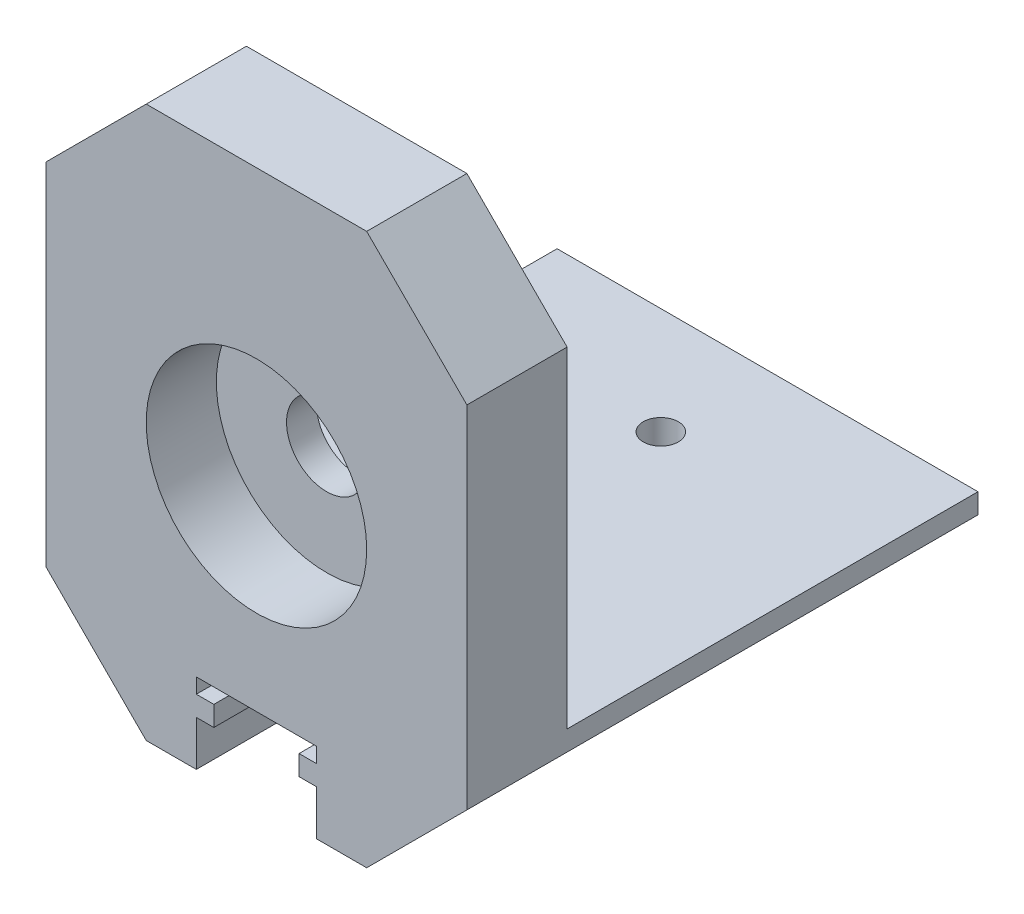
ISO-10303-21;
HEADER;
FILE_DESCRIPTION(('STEP AP214'),'2;1');
FILE_NAME('part.step','',(''),(''),'','','');
FILE_SCHEMA(('AUTOMOTIVE_DESIGN { 1 0 10303 214 1 1 1 1 }'));
ENDSEC;
DATA;
#1=APPLICATION_CONTEXT('core data for automotive mechanical design processes');
#2=APPLICATION_PROTOCOL_DEFINITION('international standard','automotive_design',2000,#1);
#3=PRODUCT_CONTEXT('',#1,'mechanical');
#4=PRODUCT('Part','Part','',(#3));
#5=PRODUCT_RELATED_PRODUCT_CATEGORY('part','',(#4));
#6=PRODUCT_DEFINITION_FORMATION('','',#4);
#7=PRODUCT_DEFINITION_CONTEXT('part definition',#1,'design');
#8=PRODUCT_DEFINITION('design','',#6,#7);
#9=PRODUCT_DEFINITION_SHAPE('','',#8);
#10=(LENGTH_UNIT() NAMED_UNIT(*) SI_UNIT(.MILLI.,.METRE.));
#11=(NAMED_UNIT(*) PLANE_ANGLE_UNIT() SI_UNIT($,.RADIAN.));
#12=(NAMED_UNIT(*) SI_UNIT($,.STERADIAN.) SOLID_ANGLE_UNIT());
#13=UNCERTAINTY_MEASURE_WITH_UNIT(LENGTH_MEASURE(1.E-05),#10,'distance_accuracy_value','');
#14=(GEOMETRIC_REPRESENTATION_CONTEXT(3) GLOBAL_UNCERTAINTY_ASSIGNED_CONTEXT((#13)) GLOBAL_UNIT_ASSIGNED_CONTEXT((#10,
#11,#12)) REPRESENTATION_CONTEXT('',''));
#15=CARTESIAN_POINT('',(0.,0.,0.));
#16=DIRECTION('',(0.,0.,1.));
#17=DIRECTION('',(1.,0.,0.));
#18=AXIS2_PLACEMENT_3D('',#15,#16,#17);
#19=CARTESIAN_POINT('',(21.,-27.5,10.));
#20=DIRECTION('',(-1.,0.,0.));
#21=DIRECTION('',(0.,0.,1.));
#22=AXIS2_PLACEMENT_3D('',#19,#20,#21);
#23=PLANE('',#22);
#24=DIRECTION('',(0.,1.,0.));
#25=VECTOR('',#24,1.);
#26=CARTESIAN_POINT('',(21.,-27.5,10.));
#27=LINE('',#26,#25);
#28=CARTESIAN_POINT('',(21.,-17.5,10.));
#29=VERTEX_POINT('',#28);
#30=CARTESIAN_POINT('',(21.,17.5,10.));
#31=VERTEX_POINT('',#30);
#32=EDGE_CURVE('E272',#29,#31,#27,.T.);
#33=ORIENTED_EDGE('',*,*,#32,.F.);
#34=DIRECTION('',(0.,0.,-1.));
#35=VECTOR('',#34,1.);
#36=CARTESIAN_POINT('',(21.,-17.5,10.));
#37=LINE('',#36,#35);
#38=CARTESIAN_POINT('',(21.,-17.5,-41.));
#39=VERTEX_POINT('',#38);
#40=EDGE_CURVE('E354',#29,#39,#37,.T.);
#41=ORIENTED_EDGE('',*,*,#40,.T.);
#42=DIRECTION('',(0.,-1.,0.));
#43=VECTOR('',#42,1.);
#44=CARTESIAN_POINT('',(21.,-27.5,-41.));
#45=LINE('',#44,#43);
#46=CARTESIAN_POINT('',(21.,-15.5,-41.));
#47=VERTEX_POINT('',#46);
#48=EDGE_CURVE('E197',#47,#39,#45,.T.);
#49=ORIENTED_EDGE('',*,*,#48,.F.);
#50=DIRECTION('',(0.,0.,1.));
#51=VECTOR('',#50,1.);
#52=CARTESIAN_POINT('',(21.,-15.5,-41.));
#53=LINE('',#52,#51);
#54=CARTESIAN_POINT('',(21.,-15.5,0.));
#55=VERTEX_POINT('',#54);
#56=EDGE_CURVE('E249',#47,#55,#53,.T.);
#57=ORIENTED_EDGE('',*,*,#56,.T.);
#58=DIRECTION('',(0.,1.,0.));
#59=VECTOR('',#58,1.);
#60=CARTESIAN_POINT('',(21.,-27.5,0.));
#61=LINE('',#60,#59);
#62=CARTESIAN_POINT('',(21.,17.5,0.));
#63=VERTEX_POINT('',#62);
#64=EDGE_CURVE('E269',#55,#63,#61,.T.);
#65=ORIENTED_EDGE('',*,*,#64,.T.);
#66=DIRECTION('',(0.,0.,1.));
#67=VECTOR('',#66,1.);
#68=CARTESIAN_POINT('',(21.,17.5,10.));
#69=LINE('',#68,#67);
#70=EDGE_CURVE('E352',#63,#31,#69,.T.);
#71=ORIENTED_EDGE('',*,*,#70,.T.);
#72=EDGE_LOOP('',(#33,#41,#49,#57,#65,#71));
#73=FACE_BOUND('',#72,.T.);
#74=ADVANCED_FACE('F34',(#73),#23,.F.);
#75=CARTESIAN_POINT('',(-21.,27.5,10.));
#76=DIRECTION('',(0.,-1.,0.));
#77=DIRECTION('',(0.,0.,-1.));
#78=AXIS2_PLACEMENT_3D('',#75,#76,#77);
#79=PLANE('',#78);
#80=DIRECTION('',(-1.,0.,0.));
#81=VECTOR('',#80,1.);
#82=CARTESIAN_POINT('',(-21.,27.5,0.));
#83=LINE('',#82,#81);
#84=CARTESIAN_POINT('',(11.,27.5,0.));
#85=VERTEX_POINT('',#84);
#86=CARTESIAN_POINT('',(-11.,27.5,0.));
#87=VERTEX_POINT('',#86);
#88=EDGE_CURVE('E309',#85,#87,#83,.T.);
#89=ORIENTED_EDGE('',*,*,#88,.T.);
#90=DIRECTION('',(0.,0.,1.));
#91=VECTOR('',#90,1.);
#92=CARTESIAN_POINT('',(-11.,27.5,10.));
#93=LINE('',#92,#91);
#94=CARTESIAN_POINT('',(-11.,27.5,10.));
#95=VERTEX_POINT('',#94);
#96=EDGE_CURVE('E11',#87,#95,#93,.T.);
#97=ORIENTED_EDGE('',*,*,#96,.T.);
#98=DIRECTION('',(-1.,0.,0.));
#99=VECTOR('',#98,1.);
#100=CARTESIAN_POINT('',(-21.,27.5,10.));
#101=LINE('',#100,#99);
#102=CARTESIAN_POINT('',(11.,27.5,10.));
#103=VERTEX_POINT('',#102);
#104=EDGE_CURVE('E275',#103,#95,#101,.T.);
#105=ORIENTED_EDGE('',*,*,#104,.F.);
#106=DIRECTION('',(0.,0.,-1.));
#107=VECTOR('',#106,1.);
#108=CARTESIAN_POINT('',(11.,27.5,10.));
#109=LINE('',#108,#107);
#110=EDGE_CURVE('E43',#103,#85,#109,.T.);
#111=ORIENTED_EDGE('',*,*,#110,.T.);
#112=EDGE_LOOP('',(#89,#97,#105,#111));
#113=FACE_BOUND('',#112,.T.);
#114=ADVANCED_FACE('F362',(#113),#79,.F.);
#115=CARTESIAN_POINT('',(-21.,-27.5,10.));
#116=DIRECTION('',(1.,0.,0.));
#117=DIRECTION('',(0.,0.,-1.));
#118=AXIS2_PLACEMENT_3D('',#115,#116,#117);
#119=PLANE('',#118);
#120=DIRECTION('',(0.,1.,0.));
#121=VECTOR('',#120,1.);
#122=CARTESIAN_POINT('',(-21.,-27.5,-41.));
#123=LINE('',#122,#121);
#124=CARTESIAN_POINT('',(-21.,-17.5,-41.));
#125=VERTEX_POINT('',#124);
#126=CARTESIAN_POINT('',(-21.,-15.5,-41.));
#127=VERTEX_POINT('',#126);
#128=EDGE_CURVE('E245',#125,#127,#123,.T.);
#129=ORIENTED_EDGE('',*,*,#128,.F.);
#130=DIRECTION('',(0.,0.,1.));
#131=VECTOR('',#130,1.);
#132=CARTESIAN_POINT('',(-21.,-17.5,10.));
#133=LINE('',#132,#131);
#134=CARTESIAN_POINT('',(-21.,-17.5,10.));
#135=VERTEX_POINT('',#134);
#136=EDGE_CURVE('E342',#125,#135,#133,.T.);
#137=ORIENTED_EDGE('',*,*,#136,.T.);
#138=DIRECTION('',(0.,-1.,0.));
#139=VECTOR('',#138,1.);
#140=CARTESIAN_POINT('',(-21.,-27.5,10.));
#141=LINE('',#140,#139);
#142=CARTESIAN_POINT('',(-21.,17.5,10.));
#143=VERTEX_POINT('',#142);
#144=EDGE_CURVE('E279',#143,#135,#141,.T.);
#145=ORIENTED_EDGE('',*,*,#144,.F.);
#146=DIRECTION('',(0.,0.,-1.));
#147=VECTOR('',#146,1.);
#148=CARTESIAN_POINT('',(-21.,17.5,10.));
#149=LINE('',#148,#147);
#150=CARTESIAN_POINT('',(-21.,17.5,0.));
#151=VERTEX_POINT('',#150);
#152=EDGE_CURVE('E339',#143,#151,#149,.T.);
#153=ORIENTED_EDGE('',*,*,#152,.T.);
#154=DIRECTION('',(0.,-1.,0.));
#155=VECTOR('',#154,1.);
#156=CARTESIAN_POINT('',(-21.,-27.5,0.));
#157=LINE('',#156,#155);
#158=CARTESIAN_POINT('',(-21.,-15.5,0.));
#159=VERTEX_POINT('',#158);
#160=EDGE_CURVE('E276',#151,#159,#157,.T.);
#161=ORIENTED_EDGE('',*,*,#160,.T.);
#162=DIRECTION('',(0.,0.,1.));
#163=VECTOR('',#162,1.);
#164=CARTESIAN_POINT('',(-21.,-15.5,-41.));
#165=LINE('',#164,#163);
#166=EDGE_CURVE('E256',#127,#159,#165,.T.);
#167=ORIENTED_EDGE('',*,*,#166,.F.);
#168=EDGE_LOOP('',(#129,#137,#145,#153,#161,#167));
#169=FACE_BOUND('',#168,.T.);
#170=ADVANCED_FACE('F438',(#169),#119,.F.);
#171=CARTESIAN_POINT('',(-21.,-27.5,10.));
#172=DIRECTION('',(0.,1.,0.));
#173=DIRECTION('',(0.,0.,1.));
#174=AXIS2_PLACEMENT_3D('',#171,#172,#173);
#175=PLANE('',#174);
#176=DIRECTION('',(1.,0.,0.));
#177=VECTOR('',#176,1.);
#178=CARTESIAN_POINT('',(-21.,-27.5,10.));
#179=LINE('',#178,#177);
#180=CARTESIAN_POINT('',(-11.,-27.5,10.));
#181=VERTEX_POINT('',#180);
#182=CARTESIAN_POINT('',(-6.,-27.5,10.));
#183=VERTEX_POINT('',#182);
#184=EDGE_CURVE('E282',#181,#183,#179,.T.);
#185=ORIENTED_EDGE('',*,*,#184,.F.);
#186=DIRECTION('',(0.,0.,-1.));
#187=VECTOR('',#186,1.);
#188=CARTESIAN_POINT('',(-11.,-27.5,10.));
#189=LINE('',#188,#187);
#190=CARTESIAN_POINT('',(-11.,-27.5,-41.));
#191=VERTEX_POINT('',#190);
#192=EDGE_CURVE('E333',#181,#191,#189,.T.);
#193=ORIENTED_EDGE('',*,*,#192,.T.);
#194=DIRECTION('',(-1.,0.,0.));
#195=VECTOR('',#194,1.);
#196=CARTESIAN_POINT('',(-21.,-27.5,-41.));
#197=LINE('',#196,#195);
#198=CARTESIAN_POINT('',(-6.,-27.5,-41.));
#199=VERTEX_POINT('',#198);
#200=EDGE_CURVE('E243',#199,#191,#197,.T.);
#201=ORIENTED_EDGE('',*,*,#200,.F.);
#202=DIRECTION('',(0.,0.,-1.));
#203=VECTOR('',#202,1.);
#204=CARTESIAN_POINT('',(-6.,-27.5,10.));
#205=LINE('',#204,#203);
#206=EDGE_CURVE('E331',#183,#199,#205,.T.);
#207=ORIENTED_EDGE('',*,*,#206,.F.);
#208=EDGE_LOOP('',(#185,#193,#201,#207));
#209=FACE_BOUND('',#208,.T.);
#210=ADVANCED_FACE('F431',(#209),#175,.F.);
#211=CARTESIAN_POINT('',(-6.00000000000005,-23.0000000000001,10.));
#212=DIRECTION('',(-1.,0.,0.));
#213=DIRECTION('',(0.,-1.,0.));
#214=AXIS2_PLACEMENT_3D('',#211,#212,#213);
#215=PLANE('',#214);
#216=ORIENTED_EDGE('',*,*,#206,.T.);
#217=DIRECTION('',(0.,-1.,0.));
#218=VECTOR('',#217,1.);
#219=CARTESIAN_POINT('',(-6.,-27.5,-41.));
#220=LINE('',#219,#218);
#221=CARTESIAN_POINT('',(-6.,-23.,-41.));
#222=VERTEX_POINT('',#221);
#223=EDGE_CURVE('E240',#222,#199,#220,.T.);
#224=ORIENTED_EDGE('',*,*,#223,.F.);
#225=DIRECTION('',(0.,0.,-1.));
#226=VECTOR('',#225,1.);
#227=CARTESIAN_POINT('',(-6.00000000000005,-23.0000000000001,10.));
#228=LINE('',#227,#226);
#229=CARTESIAN_POINT('',(-6.00000000000005,-23.0000000000001,10.));
#230=VERTEX_POINT('',#229);
#231=EDGE_CURVE('E329',#230,#222,#228,.T.);
#232=ORIENTED_EDGE('',*,*,#231,.F.);
#233=DIRECTION('',(0.,1.,0.));
#234=VECTOR('',#233,1.);
#235=CARTESIAN_POINT('',(-6.00000000000005,-23.0000000000001,10.));
#236=LINE('',#235,#234);
#237=EDGE_CURVE('E284',#183,#230,#236,.T.);
#238=ORIENTED_EDGE('',*,*,#237,.F.);
#239=EDGE_LOOP('',(#216,#224,#232,#238));
#240=FACE_BOUND('',#239,.T.);
#241=ADVANCED_FACE('F426',(#240),#215,.F.);
#242=CARTESIAN_POINT('',(-6.00000000000005,-23.0000000000001,10.));
#243=DIRECTION('',(0.,1.,0.));
#244=DIRECTION('',(-1.,0.,0.));
#245=AXIS2_PLACEMENT_3D('',#242,#243,#244);
#246=PLANE('',#245);
#247=ORIENTED_EDGE('',*,*,#231,.T.);
#248=DIRECTION('',(-1.,0.,0.));
#249=VECTOR('',#248,1.);
#250=CARTESIAN_POINT('',(-6.,-23.,-41.));
#251=LINE('',#250,#249);
#252=CARTESIAN_POINT('',(-4.24999999999996,-23.,-41.));
#253=VERTEX_POINT('',#252);
#254=EDGE_CURVE('E237',#253,#222,#251,.T.);
#255=ORIENTED_EDGE('',*,*,#254,.F.);
#256=DIRECTION('',(0.,0.,-1.));
#257=VECTOR('',#256,1.);
#258=CARTESIAN_POINT('',(-4.25000000000004,-23.0000000000001,10.));
#259=LINE('',#258,#257);
#260=CARTESIAN_POINT('',(-4.25000000000004,-23.0000000000001,10.));
#261=VERTEX_POINT('',#260);
#262=EDGE_CURVE('E327',#261,#253,#259,.T.);
#263=ORIENTED_EDGE('',*,*,#262,.F.);
#264=DIRECTION('',(1.,0.,0.));
#265=VECTOR('',#264,1.);
#266=CARTESIAN_POINT('',(-6.00000000000005,-23.0000000000001,10.));
#267=LINE('',#266,#265);
#268=EDGE_CURVE('E286',#230,#261,#267,.T.);
#269=ORIENTED_EDGE('',*,*,#268,.F.);
#270=EDGE_LOOP('',(#247,#255,#263,#269));
#271=FACE_BOUND('',#270,.T.);
#272=ADVANCED_FACE('F421',(#271),#246,.F.);
#273=CARTESIAN_POINT('',(-4.25000000000005,-21.0000000000001,10.));
#274=DIRECTION('',(-1.,0.,0.));
#275=DIRECTION('',(0.,-1.,0.));
#276=AXIS2_PLACEMENT_3D('',#273,#274,#275);
#277=PLANE('',#276);
#278=ORIENTED_EDGE('',*,*,#262,.T.);
#279=DIRECTION('',(0.,-1.,0.));
#280=VECTOR('',#279,1.);
#281=CARTESIAN_POINT('',(-4.24999999999996,-23.,-41.));
#282=LINE('',#281,#280);
#283=CARTESIAN_POINT('',(-4.24999999999996,-21.,-41.));
#284=VERTEX_POINT('',#283);
#285=EDGE_CURVE('E234',#284,#253,#282,.T.);
#286=ORIENTED_EDGE('',*,*,#285,.F.);
#287=DIRECTION('',(0.,0.,-1.));
#288=VECTOR('',#287,1.);
#289=CARTESIAN_POINT('',(-4.25000000000005,-21.0000000000001,10.));
#290=LINE('',#289,#288);
#291=CARTESIAN_POINT('',(-4.25000000000005,-21.0000000000001,10.));
#292=VERTEX_POINT('',#291);
#293=EDGE_CURVE('E325',#292,#284,#290,.T.);
#294=ORIENTED_EDGE('',*,*,#293,.F.);
#295=DIRECTION('',(0.,1.,0.));
#296=VECTOR('',#295,1.);
#297=CARTESIAN_POINT('',(-4.25000000000005,-21.0000000000001,10.));
#298=LINE('',#297,#296);
#299=EDGE_CURVE('E288',#261,#292,#298,.T.);
#300=ORIENTED_EDGE('',*,*,#299,.F.);
#301=EDGE_LOOP('',(#278,#286,#294,#300));
#302=FACE_BOUND('',#301,.T.);
#303=ADVANCED_FACE('F416',(#302),#277,.F.);
#304=CARTESIAN_POINT('',(-6.00000000000001,-21.0000000000001,10.));
#305=DIRECTION('',(0.,-1.,0.));
#306=DIRECTION('',(1.,0.,0.));
#307=AXIS2_PLACEMENT_3D('',#304,#305,#306);
#308=PLANE('',#307);
#309=ORIENTED_EDGE('',*,*,#293,.T.);
#310=DIRECTION('',(1.,0.,0.));
#311=VECTOR('',#310,1.);
#312=CARTESIAN_POINT('',(-4.24999999999996,-21.,-41.));
#313=LINE('',#312,#311);
#314=CARTESIAN_POINT('',(-6.,-21.,-41.));
#315=VERTEX_POINT('',#314);
#316=EDGE_CURVE('E231',#315,#284,#313,.T.);
#317=ORIENTED_EDGE('',*,*,#316,.F.);
#318=DIRECTION('',(0.,0.,-1.));
#319=VECTOR('',#318,1.);
#320=CARTESIAN_POINT('',(-6.00000000000001,-21.0000000000001,10.));
#321=LINE('',#320,#319);
#322=CARTESIAN_POINT('',(-6.00000000000001,-21.0000000000001,10.));
#323=VERTEX_POINT('',#322);
#324=EDGE_CURVE('E323',#323,#315,#321,.T.);
#325=ORIENTED_EDGE('',*,*,#324,.F.);
#326=DIRECTION('',(-1.,0.,0.));
#327=VECTOR('',#326,1.);
#328=CARTESIAN_POINT('',(-6.00000000000001,-21.0000000000001,10.));
#329=LINE('',#328,#327);
#330=EDGE_CURVE('E290',#292,#323,#329,.T.);
#331=ORIENTED_EDGE('',*,*,#330,.F.);
#332=EDGE_LOOP('',(#309,#317,#325,#331));
#333=FACE_BOUND('',#332,.T.);
#334=ADVANCED_FACE('F411',(#333),#308,.F.);
#335=CARTESIAN_POINT('',(-6.,-19.5,10.));
#336=DIRECTION('',(-1.,0.,0.));
#337=DIRECTION('',(0.,-1.,0.));
#338=AXIS2_PLACEMENT_3D('',#335,#336,#337);
#339=PLANE('',#338);
#340=ORIENTED_EDGE('',*,*,#324,.T.);
#341=DIRECTION('',(0.,-1.,0.));
#342=VECTOR('',#341,1.);
#343=CARTESIAN_POINT('',(-6.,-21.,-41.));
#344=LINE('',#343,#342);
#345=CARTESIAN_POINT('',(-6.,-19.5,-41.));
#346=VERTEX_POINT('',#345);
#347=EDGE_CURVE('E228',#346,#315,#344,.T.);
#348=ORIENTED_EDGE('',*,*,#347,.F.);
#349=DIRECTION('',(0.,0.,-1.));
#350=VECTOR('',#349,1.);
#351=CARTESIAN_POINT('',(-6.,-19.5,10.));
#352=LINE('',#351,#350);
#353=CARTESIAN_POINT('',(-6.,-19.5,10.));
#354=VERTEX_POINT('',#353);
#355=EDGE_CURVE('E321',#354,#346,#352,.T.);
#356=ORIENTED_EDGE('',*,*,#355,.F.);
#357=DIRECTION('',(0.,1.,0.));
#358=VECTOR('',#357,1.);
#359=CARTESIAN_POINT('',(-6.,-19.5,10.));
#360=LINE('',#359,#358);
#361=EDGE_CURVE('E292',#323,#354,#360,.T.);
#362=ORIENTED_EDGE('',*,*,#361,.F.);
#363=EDGE_LOOP('',(#340,#348,#356,#362));
#364=FACE_BOUND('',#363,.T.);
#365=ADVANCED_FACE('F406',(#364),#339,.F.);
#366=CARTESIAN_POINT('',(6.,-19.5,10.));
#367=DIRECTION('',(0.,1.,0.));
#368=DIRECTION('',(0.,0.,1.));
#369=AXIS2_PLACEMENT_3D('',#366,#367,#368);
#370=PLANE('',#369);
#371=CARTESIAN_POINT('',(0.,-19.5,-30.35));
#372=DIRECTION('',(0.,1.,0.));
#373=DIRECTION('',(0.,0.,1.));
#374=AXIS2_PLACEMENT_3D('',#371,#372,#373);
#375=CIRCLE('',#374,1.75);
#376=CARTESIAN_POINT('',(0.,-19.5,-28.6));
#377=VERTEX_POINT('',#376);
#378=EDGE_CURVE('E253',#377,#377,#375,.T.);
#379=ORIENTED_EDGE('',*,*,#378,.T.);
#380=EDGE_LOOP('',(#379));
#381=FACE_BOUND('',#380,.T.);
#382=CARTESIAN_POINT('',(0.,-19.5,-5.34999999999998));
#383=DIRECTION('',(0.,1.,0.));
#384=DIRECTION('',(0.,0.,1.));
#385=AXIS2_PLACEMENT_3D('',#382,#383,#384);
#386=CIRCLE('',#385,1.75);
#387=CARTESIAN_POINT('',(0.,-19.5,-3.59999999999998));
#388=VERTEX_POINT('',#387);
#389=EDGE_CURVE('E622',#388,#388,#386,.T.);
#390=ORIENTED_EDGE('',*,*,#389,.T.);
#391=EDGE_LOOP('',(#390));
#392=FACE_BOUND('',#391,.T.);
#393=ORIENTED_EDGE('',*,*,#355,.T.);
#394=DIRECTION('',(-1.,0.,0.));
#395=VECTOR('',#394,1.);
#396=CARTESIAN_POINT('',(6.,-19.5,-41.));
#397=LINE('',#396,#395);
#398=CARTESIAN_POINT('',(6.,-19.5,-41.));
#399=VERTEX_POINT('',#398);
#400=EDGE_CURVE('E225',#399,#346,#397,.T.);
#401=ORIENTED_EDGE('',*,*,#400,.F.);
#402=DIRECTION('',(0.,0.,-1.));
#403=VECTOR('',#402,1.);
#404=CARTESIAN_POINT('',(6.,-19.5,10.));
#405=LINE('',#404,#403);
#406=CARTESIAN_POINT('',(6.,-19.5,10.));
#407=VERTEX_POINT('',#406);
#408=EDGE_CURVE('E319',#407,#399,#405,.T.);
#409=ORIENTED_EDGE('',*,*,#408,.F.);
#410=DIRECTION('',(1.,0.,0.));
#411=VECTOR('',#410,1.);
#412=CARTESIAN_POINT('',(6.,-19.5,10.));
#413=LINE('',#412,#411);
#414=EDGE_CURVE('E294',#354,#407,#413,.T.);
#415=ORIENTED_EDGE('',*,*,#414,.F.);
#416=EDGE_LOOP('',(#393,#401,#409,#415));
#417=FACE_BOUND('',#416,.T.);
#418=ADVANCED_FACE('F401',(#381,#392,#417),#370,.F.);
#419=CARTESIAN_POINT('',(6.,-19.5,10.));
#420=DIRECTION('',(1.,0.,0.));
#421=DIRECTION('',(0.,1.,0.));
#422=AXIS2_PLACEMENT_3D('',#419,#420,#421);
#423=PLANE('',#422);
#424=ORIENTED_EDGE('',*,*,#408,.T.);
#425=DIRECTION('',(0.,1.,0.));
#426=VECTOR('',#425,1.);
#427=CARTESIAN_POINT('',(6.,-21.,-41.));
#428=LINE('',#427,#426);
#429=CARTESIAN_POINT('',(6.,-21.,-41.));
#430=VERTEX_POINT('',#429);
#431=EDGE_CURVE('E222',#430,#399,#428,.T.);
#432=ORIENTED_EDGE('',*,*,#431,.F.);
#433=DIRECTION('',(0.,0.,-1.));
#434=VECTOR('',#433,1.);
#435=CARTESIAN_POINT('',(6.,-21.,10.));
#436=LINE('',#435,#434);
#437=CARTESIAN_POINT('',(6.,-21.,10.));
#438=VERTEX_POINT('',#437);
#439=EDGE_CURVE('E317',#438,#430,#436,.T.);
#440=ORIENTED_EDGE('',*,*,#439,.F.);
#441=DIRECTION('',(0.,-1.,0.));
#442=VECTOR('',#441,1.);
#443=CARTESIAN_POINT('',(6.,-19.5,10.));
#444=LINE('',#443,#442);
#445=EDGE_CURVE('E296',#407,#438,#444,.T.);
#446=ORIENTED_EDGE('',*,*,#445,.F.);
#447=EDGE_LOOP('',(#424,#432,#440,#446));
#448=FACE_BOUND('',#447,.T.);
#449=ADVANCED_FACE('F396',(#448),#423,.F.);
#450=CARTESIAN_POINT('',(6.,-21.,10.));
#451=DIRECTION('',(0.,-1.,0.));
#452=DIRECTION('',(1.,0.,0.));
#453=AXIS2_PLACEMENT_3D('',#450,#451,#452);
#454=PLANE('',#453);
#455=ORIENTED_EDGE('',*,*,#439,.T.);
#456=DIRECTION('',(1.,0.,0.));
#457=VECTOR('',#456,1.);
#458=CARTESIAN_POINT('',(4.24999999999996,-21.,-41.));
#459=LINE('',#458,#457);
#460=CARTESIAN_POINT('',(4.24999999999996,-21.,-41.));
#461=VERTEX_POINT('',#460);
#462=EDGE_CURVE('E219',#461,#430,#459,.T.);
#463=ORIENTED_EDGE('',*,*,#462,.F.);
#464=DIRECTION('',(0.,0.,-1.));
#465=VECTOR('',#464,1.);
#466=CARTESIAN_POINT('',(4.24999999999996,-21.,10.));
#467=LINE('',#466,#465);
#468=CARTESIAN_POINT('',(4.24999999999996,-21.,10.));
#469=VERTEX_POINT('',#468);
#470=EDGE_CURVE('E315',#469,#461,#467,.T.);
#471=ORIENTED_EDGE('',*,*,#470,.F.);
#472=DIRECTION('',(-1.,0.,0.));
#473=VECTOR('',#472,1.);
#474=CARTESIAN_POINT('',(6.,-21.,10.));
#475=LINE('',#474,#473);
#476=EDGE_CURVE('E298',#438,#469,#475,.T.);
#477=ORIENTED_EDGE('',*,*,#476,.F.);
#478=EDGE_LOOP('',(#455,#463,#471,#477));
#479=FACE_BOUND('',#478,.T.);
#480=ADVANCED_FACE('F391',(#479),#454,.F.);
#481=CARTESIAN_POINT('',(4.24999999999996,-21.,10.));
#482=DIRECTION('',(1.,0.,0.));
#483=DIRECTION('',(0.,1.,0.));
#484=AXIS2_PLACEMENT_3D('',#481,#482,#483);
#485=PLANE('',#484);
#486=ORIENTED_EDGE('',*,*,#470,.T.);
#487=DIRECTION('',(0.,1.,0.));
#488=VECTOR('',#487,1.);
#489=CARTESIAN_POINT('',(4.24999999999996,-23.,-41.));
#490=LINE('',#489,#488);
#491=CARTESIAN_POINT('',(4.24999999999996,-23.,-41.));
#492=VERTEX_POINT('',#491);
#493=EDGE_CURVE('E213',#492,#461,#490,.T.);
#494=ORIENTED_EDGE('',*,*,#493,.F.);
#495=DIRECTION('',(0.,0.,-1.));
#496=VECTOR('',#495,1.);
#497=CARTESIAN_POINT('',(4.24999999999996,-23.,10.));
#498=LINE('',#497,#496);
#499=CARTESIAN_POINT('',(4.24999999999996,-23.,10.));
#500=VERTEX_POINT('',#499);
#501=EDGE_CURVE('E313',#500,#492,#498,.T.);
#502=ORIENTED_EDGE('',*,*,#501,.F.);
#503=DIRECTION('',(0.,-1.,0.));
#504=VECTOR('',#503,1.);
#505=CARTESIAN_POINT('',(4.24999999999996,-21.,10.));
#506=LINE('',#505,#504);
#507=EDGE_CURVE('E300',#469,#500,#506,.T.);
#508=ORIENTED_EDGE('',*,*,#507,.F.);
#509=EDGE_LOOP('',(#486,#494,#502,#508));
#510=FACE_BOUND('',#509,.T.);
#511=ADVANCED_FACE('F387',(#510),#485,.F.);
#512=CARTESIAN_POINT('',(6.,-23.,10.));
#513=DIRECTION('',(0.,1.,0.));
#514=DIRECTION('',(-1.,0.,0.));
#515=AXIS2_PLACEMENT_3D('',#512,#513,#514);
#516=PLANE('',#515);
#517=ORIENTED_EDGE('',*,*,#501,.T.);
#518=DIRECTION('',(-1.,0.,0.));
#519=VECTOR('',#518,1.);
#520=CARTESIAN_POINT('',(6.,-23.,-41.));
#521=LINE('',#520,#519);
#522=CARTESIAN_POINT('',(6.,-23.,-41.));
#523=VERTEX_POINT('',#522);
#524=EDGE_CURVE('E211',#523,#492,#521,.T.);
#525=ORIENTED_EDGE('',*,*,#524,.F.);
#526=DIRECTION('',(0.,0.,-1.));
#527=VECTOR('',#526,1.);
#528=CARTESIAN_POINT('',(6.,-23.,10.));
#529=LINE('',#528,#527);
#530=CARTESIAN_POINT('',(6.,-23.,10.));
#531=VERTEX_POINT('',#530);
#532=EDGE_CURVE('E207',#531,#523,#529,.T.);
#533=ORIENTED_EDGE('',*,*,#532,.F.);
#534=DIRECTION('',(1.,0.,0.));
#535=VECTOR('',#534,1.);
#536=CARTESIAN_POINT('',(6.,-23.,10.));
#537=LINE('',#536,#535);
#538=EDGE_CURVE('E302',#500,#531,#537,.T.);
#539=ORIENTED_EDGE('',*,*,#538,.F.);
#540=EDGE_LOOP('',(#517,#525,#533,#539));
#541=FACE_BOUND('',#540,.T.);
#542=ADVANCED_FACE('F383',(#541),#516,.F.);
#543=CARTESIAN_POINT('',(6.,-23.,10.));
#544=DIRECTION('',(1.,0.,0.));
#545=DIRECTION('',(0.,1.,0.));
#546=AXIS2_PLACEMENT_3D('',#543,#544,#545);
#547=PLANE('',#546);
#548=ORIENTED_EDGE('',*,*,#532,.T.);
#549=DIRECTION('',(0.,1.,0.));
#550=VECTOR('',#549,1.);
#551=CARTESIAN_POINT('',(6.,-27.5,-41.));
#552=LINE('',#551,#550);
#553=CARTESIAN_POINT('',(6.,-27.5,-41.));
#554=VERTEX_POINT('',#553);
#555=EDGE_CURVE('E191',#554,#523,#552,.T.);
#556=ORIENTED_EDGE('',*,*,#555,.F.);
#557=DIRECTION('',(0.,0.,-1.));
#558=VECTOR('',#557,1.);
#559=CARTESIAN_POINT('',(6.,-27.5,10.));
#560=LINE('',#559,#558);
#561=CARTESIAN_POINT('',(6.,-27.5,10.));
#562=VERTEX_POINT('',#561);
#563=EDGE_CURVE('E201',#562,#554,#560,.T.);
#564=ORIENTED_EDGE('',*,*,#563,.F.);
#565=DIRECTION('',(0.,-1.,0.));
#566=VECTOR('',#565,1.);
#567=CARTESIAN_POINT('',(6.,-23.,10.));
#568=LINE('',#567,#566);
#569=EDGE_CURVE('E304',#531,#562,#568,.T.);
#570=ORIENTED_EDGE('',*,*,#569,.F.);
#571=EDGE_LOOP('',(#548,#556,#564,#570));
#572=FACE_BOUND('',#571,.T.);
#573=ADVANCED_FACE('F209',(#572),#547,.F.);
#574=CARTESIAN_POINT('',(6.,-27.5,10.));
#575=DIRECTION('',(0.,1.,0.));
#576=DIRECTION('',(0.,0.,1.));
#577=AXIS2_PLACEMENT_3D('',#574,#575,#576);
#578=PLANE('',#577);
#579=DIRECTION('',(-1.,0.,0.));
#580=VECTOR('',#579,1.);
#581=CARTESIAN_POINT('',(21.,-27.5,-41.));
#582=LINE('',#581,#580);
#583=CARTESIAN_POINT('',(11.,-27.5,-41.));
#584=VERTEX_POINT('',#583);
#585=EDGE_CURVE('E185',#584,#554,#582,.T.);
#586=ORIENTED_EDGE('',*,*,#585,.F.);
#587=DIRECTION('',(0.,0.,1.));
#588=VECTOR('',#587,1.);
#589=CARTESIAN_POINT('',(11.,-27.5,10.));
#590=LINE('',#589,#588);
#591=CARTESIAN_POINT('',(11.,-27.5,10.));
#592=VERTEX_POINT('',#591);
#593=EDGE_CURVE('E357',#584,#592,#590,.T.);
#594=ORIENTED_EDGE('',*,*,#593,.T.);
#595=DIRECTION('',(1.,0.,0.));
#596=VECTOR('',#595,1.);
#597=CARTESIAN_POINT('',(6.,-27.5,10.));
#598=LINE('',#597,#596);
#599=EDGE_CURVE('E204',#562,#592,#598,.T.);
#600=ORIENTED_EDGE('',*,*,#599,.F.);
#601=ORIENTED_EDGE('',*,*,#563,.T.);
#602=EDGE_LOOP('',(#586,#594,#600,#601));
#603=FACE_BOUND('',#602,.T.);
#604=ADVANCED_FACE('F202',(#603),#578,.F.);
#605=CARTESIAN_POINT('',(0.,0.,10.));
#606=DIRECTION('',(0.,0.,-1.));
#607=DIRECTION('',(-1.,0.,0.));
#608=AXIS2_PLACEMENT_3D('',#605,#606,#607);
#609=PLANE('',#608);
#610=CARTESIAN_POINT('',(0.,0.,10.));
#611=DIRECTION('',(0.,0.,1.));
#612=DIRECTION('',(1.,0.,0.));
#613=AXIS2_PLACEMENT_3D('',#610,#611,#612);
#614=CIRCLE('',#613,11.);
#615=CARTESIAN_POINT('',(11.,0.,10.));
#616=VERTEX_POINT('',#615);
#617=EDGE_CURVE('E263',#616,#616,#614,.T.);
#618=ORIENTED_EDGE('',*,*,#617,.F.);
#619=EDGE_LOOP('',(#618));
#620=FACE_BOUND('',#619,.T.);
#621=ORIENTED_EDGE('',*,*,#144,.T.);
#622=DIRECTION('',(-0.707106781186546,0.707106781186549,0.));
#623=VECTOR('',#622,1.);
#624=CARTESIAN_POINT('',(-11.,-27.5,10.));
#625=LINE('',#624,#623);
#626=EDGE_CURVE('E350',#135,#181,#625,.F.);
#627=ORIENTED_EDGE('',*,*,#626,.T.);
#628=ORIENTED_EDGE('',*,*,#184,.T.);
#629=ORIENTED_EDGE('',*,*,#237,.T.);
#630=ORIENTED_EDGE('',*,*,#268,.T.);
#631=ORIENTED_EDGE('',*,*,#299,.T.);
#632=ORIENTED_EDGE('',*,*,#330,.T.);
#633=ORIENTED_EDGE('',*,*,#361,.T.);
#634=ORIENTED_EDGE('',*,*,#414,.T.);
#635=ORIENTED_EDGE('',*,*,#445,.T.);
#636=ORIENTED_EDGE('',*,*,#476,.T.);
#637=ORIENTED_EDGE('',*,*,#507,.T.);
#638=ORIENTED_EDGE('',*,*,#538,.T.);
#639=ORIENTED_EDGE('',*,*,#569,.T.);
#640=ORIENTED_EDGE('',*,*,#599,.T.);
#641=DIRECTION('',(-0.707106781186549,-0.707106781186546,0.));
#642=VECTOR('',#641,1.);
#643=CARTESIAN_POINT('',(21.,-17.5,10.));
#644=LINE('',#643,#642);
#645=EDGE_CURVE('E348',#592,#29,#644,.F.);
#646=ORIENTED_EDGE('',*,*,#645,.T.);
#647=ORIENTED_EDGE('',*,*,#32,.T.);
#648=DIRECTION('',(0.707106781186546,-0.707106781186549,0.));
#649=VECTOR('',#648,1.);
#650=CARTESIAN_POINT('',(11.,27.5,10.));
#651=LINE('',#650,#649);
#652=EDGE_CURVE('E344',#31,#103,#651,.F.);
#653=ORIENTED_EDGE('',*,*,#652,.T.);
#654=ORIENTED_EDGE('',*,*,#104,.T.);
#655=DIRECTION('',(0.707106781186549,0.707106781186546,0.));
#656=VECTOR('',#655,1.);
#657=CARTESIAN_POINT('',(-21.,17.5,10.));
#658=LINE('',#657,#656);
#659=EDGE_CURVE('E346',#95,#143,#658,.F.);
#660=ORIENTED_EDGE('',*,*,#659,.T.);
#661=EDGE_LOOP('',(#621,#627,#628,#629,#630,#631,#632,#633,#634,#635,#636,#637,#638,#639,#640,
#646,#647,#653,#654,#660));
#662=FACE_BOUND('',#661,.T.);
#663=ADVANCED_FACE('F373',(#620,#662),#609,.F.);
#664=CARTESIAN_POINT('',(0.,0.,0.));
#665=DIRECTION('',(0.,0.,-1.));
#666=DIRECTION('',(-1.,0.,0.));
#667=AXIS2_PLACEMENT_3D('',#664,#665,#666);
#668=PLANE('',#667);
#669=ORIENTED_EDGE('',*,*,#160,.F.);
#670=DIRECTION('',(-0.707106781186549,-0.707106781186546,0.));
#671=VECTOR('',#670,1.);
#672=CARTESIAN_POINT('',(-19.25,19.25,0.));
#673=LINE('',#672,#671);
#674=EDGE_CURVE('E50',#151,#87,#673,.F.);
#675=ORIENTED_EDGE('',*,*,#674,.T.);
#676=ORIENTED_EDGE('',*,*,#88,.F.);
#677=DIRECTION('',(-0.707106781186546,0.707106781186549,0.));
#678=VECTOR('',#677,1.);
#679=CARTESIAN_POINT('',(19.25,19.2499999999999,0.));
#680=LINE('',#679,#678);
#681=EDGE_CURVE('E58',#85,#63,#680,.F.);
#682=ORIENTED_EDGE('',*,*,#681,.T.);
#683=ORIENTED_EDGE('',*,*,#64,.F.);
#684=DIRECTION('',(1.,0.,0.));
#685=VECTOR('',#684,1.);
#686=CARTESIAN_POINT('',(21.,-15.5,0.));
#687=LINE('',#686,#685);
#688=EDGE_CURVE('E250',#159,#55,#687,.T.);
#689=ORIENTED_EDGE('',*,*,#688,.F.);
#690=EDGE_LOOP('',(#669,#675,#676,#682,#683,#689));
#691=FACE_BOUND('',#690,.T.);
#692=CARTESIAN_POINT('',(0.,0.,0.));
#693=DIRECTION('',(0.,0.,1.));
#694=DIRECTION('',(1.,0.,0.));
#695=AXIS2_PLACEMENT_3D('',#692,#693,#694);
#696=CIRCLE('',#695,4.);
#697=CARTESIAN_POINT('',(4.,0.,0.));
#698=VERTEX_POINT('',#697);
#699=EDGE_CURVE('E260',#698,#698,#696,.T.);
#700=ORIENTED_EDGE('',*,*,#699,.T.);
#701=EDGE_LOOP('',(#700));
#702=FACE_BOUND('',#701,.T.);
#703=ADVANCED_FACE('F365',(#691,#702),#668,.T.);
#704=CARTESIAN_POINT('',(0.,0.,3.));
#705=DIRECTION('',(0.,0.,1.));
#706=DIRECTION('',(1.,0.,0.));
#707=AXIS2_PLACEMENT_3D('',#704,#705,#706);
#708=CYLINDRICAL_SURFACE('',#707,11.);
#709=CARTESIAN_POINT('',(0.,0.,3.));
#710=DIRECTION('',(0.,0.,1.));
#711=DIRECTION('',(1.,0.,0.));
#712=AXIS2_PLACEMENT_3D('',#709,#710,#711);
#713=CIRCLE('',#712,11.);
#714=CARTESIAN_POINT('',(11.,0.,3.));
#715=VERTEX_POINT('',#714);
#716=EDGE_CURVE('E266',#715,#715,#713,.T.);
#717=ORIENTED_EDGE('',*,*,#716,.F.);
#718=EDGE_LOOP('',(#717));
#719=FACE_BOUND('',#718,.T.);
#720=ORIENTED_EDGE('',*,*,#617,.T.);
#721=EDGE_LOOP('',(#720));
#722=FACE_BOUND('',#721,.T.);
#723=ADVANCED_FACE('F495',(#719,#722),#708,.F.);
#724=CARTESIAN_POINT('',(0.,0.,3.));
#725=DIRECTION('',(0.,0.,1.));
#726=DIRECTION('',(1.,0.,0.));
#727=AXIS2_PLACEMENT_3D('',#724,#725,#726);
#728=PLANE('',#727);
#729=CARTESIAN_POINT('',(0.,0.,3.));
#730=DIRECTION('',(0.,0.,1.));
#731=DIRECTION('',(1.,0.,0.));
#732=AXIS2_PLACEMENT_3D('',#729,#730,#731);
#733=CIRCLE('',#732,4.);
#734=CARTESIAN_POINT('',(4.,0.,3.));
#735=VERTEX_POINT('',#734);
#736=EDGE_CURVE('E259',#735,#735,#733,.T.);
#737=ORIENTED_EDGE('',*,*,#736,.F.);
#738=EDGE_LOOP('',(#737));
#739=FACE_BOUND('',#738,.T.);
#740=ORIENTED_EDGE('',*,*,#716,.T.);
#741=EDGE_LOOP('',(#740));
#742=FACE_BOUND('',#741,.T.);
#743=ADVANCED_FACE('F491',(#739,#742),#728,.T.);
#744=CARTESIAN_POINT('',(0.,0.,0.));
#745=DIRECTION('',(0.,0.,1.));
#746=DIRECTION('',(1.,0.,0.));
#747=AXIS2_PLACEMENT_3D('',#744,#745,#746);
#748=CYLINDRICAL_SURFACE('',#747,4.);
#749=ORIENTED_EDGE('',*,*,#699,.F.);
#750=EDGE_LOOP('',(#749));
#751=FACE_BOUND('',#750,.T.);
#752=ORIENTED_EDGE('',*,*,#736,.T.);
#753=EDGE_LOOP('',(#752));
#754=FACE_BOUND('',#753,.T.);
#755=ADVANCED_FACE('F484',(#751,#754),#748,.F.);
#756=CARTESIAN_POINT('',(21.,-15.5,-41.));
#757=DIRECTION('',(0.,-1.,0.));
#758=DIRECTION('',(0.,0.,-1.));
#759=AXIS2_PLACEMENT_3D('',#756,#757,#758);
#760=PLANE('',#759);
#761=CARTESIAN_POINT('',(0.,-15.5,-30.35));
#762=DIRECTION('',(0.,1.,0.));
#763=DIRECTION('',(-1.,0.,0.));
#764=AXIS2_PLACEMENT_3D('',#761,#762,#763);
#765=CIRCLE('',#764,1.75);
#766=CARTESIAN_POINT('',(-1.75,-15.5,-30.35));
#767=VERTEX_POINT('',#766);
#768=EDGE_CURVE('E619',#767,#767,#765,.T.);
#769=ORIENTED_EDGE('',*,*,#768,.F.);
#770=EDGE_LOOP('',(#769));
#771=FACE_BOUND('',#770,.T.);
#772=CARTESIAN_POINT('',(0.,-15.5,-5.34999999999998));
#773=DIRECTION('',(0.,1.,0.));
#774=DIRECTION('',(-1.,0.,0.));
#775=AXIS2_PLACEMENT_3D('',#772,#773,#774);
#776=CIRCLE('',#775,1.75);
#777=CARTESIAN_POINT('',(-1.75,-15.5,-5.34999999999998));
#778=VERTEX_POINT('',#777);
#779=EDGE_CURVE('E628',#778,#778,#776,.T.);
#780=ORIENTED_EDGE('',*,*,#779,.F.);
#781=EDGE_LOOP('',(#780));
#782=FACE_BOUND('',#781,.T.);
#783=ORIENTED_EDGE('',*,*,#688,.T.);
#784=ORIENTED_EDGE('',*,*,#56,.F.);
#785=DIRECTION('',(1.,0.,0.));
#786=VECTOR('',#785,1.);
#787=CARTESIAN_POINT('',(21.,-15.5,-41.));
#788=LINE('',#787,#786);
#789=EDGE_CURVE('E247',#127,#47,#788,.T.);
#790=ORIENTED_EDGE('',*,*,#789,.F.);
#791=ORIENTED_EDGE('',*,*,#166,.T.);
#792=EDGE_LOOP('',(#783,#784,#790,#791));
#793=FACE_BOUND('',#792,.T.);
#794=ADVANCED_FACE('F478',(#771,#782,#793),#760,.F.);
#795=CARTESIAN_POINT('',(0.,0.,-41.));
#796=DIRECTION('',(0.,0.,1.));
#797=DIRECTION('',(1.,0.,0.));
#798=AXIS2_PLACEMENT_3D('',#795,#796,#797);
#799=PLANE('',#798);
#800=ORIENTED_EDGE('',*,*,#200,.T.);
#801=DIRECTION('',(0.707106781186546,-0.707106781186549,0.));
#802=VECTOR('',#801,1.);
#803=CARTESIAN_POINT('',(-11.,-27.5,-41.));
#804=LINE('',#803,#802);
#805=EDGE_CURVE('E337',#191,#125,#804,.F.);
#806=ORIENTED_EDGE('',*,*,#805,.T.);
#807=ORIENTED_EDGE('',*,*,#128,.T.);
#808=ORIENTED_EDGE('',*,*,#789,.T.);
#809=ORIENTED_EDGE('',*,*,#48,.T.);
#810=DIRECTION('',(0.707106781186549,0.707106781186546,0.));
#811=VECTOR('',#810,1.);
#812=CARTESIAN_POINT('',(21.,-17.5,-41.));
#813=LINE('',#812,#811);
#814=EDGE_CURVE('E194',#39,#584,#813,.F.);
#815=ORIENTED_EDGE('',*,*,#814,.T.);
#816=ORIENTED_EDGE('',*,*,#585,.T.);
#817=ORIENTED_EDGE('',*,*,#555,.T.);
#818=ORIENTED_EDGE('',*,*,#524,.T.);
#819=ORIENTED_EDGE('',*,*,#493,.T.);
#820=ORIENTED_EDGE('',*,*,#462,.T.);
#821=ORIENTED_EDGE('',*,*,#431,.T.);
#822=ORIENTED_EDGE('',*,*,#400,.T.);
#823=ORIENTED_EDGE('',*,*,#347,.T.);
#824=ORIENTED_EDGE('',*,*,#316,.T.);
#825=ORIENTED_EDGE('',*,*,#285,.T.);
#826=ORIENTED_EDGE('',*,*,#254,.T.);
#827=ORIENTED_EDGE('',*,*,#223,.T.);
#828=EDGE_LOOP('',(#800,#806,#807,#808,#809,#815,#816,#817,#818,#819,#820,#821,#822,#823,#824,
#825,#826,#827));
#829=FACE_BOUND('',#828,.T.);
#830=ADVANCED_FACE('F188',(#829),#799,.F.);
#831=CARTESIAN_POINT('',(-11.,-27.5,10.));
#832=DIRECTION('',(0.707106781186549,0.707106781186546,0.));
#833=DIRECTION('',(0.,0.,-1.));
#834=AXIS2_PLACEMENT_3D('',#831,#832,#833);
#835=PLANE('',#834);
#836=ORIENTED_EDGE('',*,*,#626,.F.);
#837=ORIENTED_EDGE('',*,*,#136,.F.);
#838=ORIENTED_EDGE('',*,*,#805,.F.);
#839=ORIENTED_EDGE('',*,*,#192,.F.);
#840=EDGE_LOOP('',(#836,#837,#838,#839));
#841=FACE_BOUND('',#840,.T.);
#842=ADVANCED_FACE('F442',(#841),#835,.F.);
#843=CARTESIAN_POINT('',(21.,-17.5,10.));
#844=DIRECTION('',(-0.707106781186546,0.707106781186549,0.));
#845=DIRECTION('',(0.,0.,-1.));
#846=AXIS2_PLACEMENT_3D('',#843,#844,#845);
#847=PLANE('',#846);
#848=ORIENTED_EDGE('',*,*,#645,.F.);
#849=ORIENTED_EDGE('',*,*,#593,.F.);
#850=ORIENTED_EDGE('',*,*,#814,.F.);
#851=ORIENTED_EDGE('',*,*,#40,.F.);
#852=EDGE_LOOP('',(#848,#849,#850,#851));
#853=FACE_BOUND('',#852,.T.);
#854=ADVANCED_FACE('F378',(#853),#847,.F.);
#855=CARTESIAN_POINT('',(-21.,17.5,10.));
#856=DIRECTION('',(0.707106781186546,-0.707106781186549,0.));
#857=DIRECTION('',(0.,0.,-1.));
#858=AXIS2_PLACEMENT_3D('',#855,#856,#857);
#859=PLANE('',#858);
#860=ORIENTED_EDGE('',*,*,#659,.F.);
#861=ORIENTED_EDGE('',*,*,#96,.F.);
#862=ORIENTED_EDGE('',*,*,#674,.F.);
#863=ORIENTED_EDGE('',*,*,#152,.F.);
#864=EDGE_LOOP('',(#860,#861,#862,#863));
#865=FACE_BOUND('',#864,.T.);
#866=ADVANCED_FACE('F445',(#865),#859,.F.);
#867=CARTESIAN_POINT('',(11.,27.5,10.));
#868=DIRECTION('',(-0.707106781186549,-0.707106781186546,0.));
#869=DIRECTION('',(0.,0.,-1.));
#870=AXIS2_PLACEMENT_3D('',#867,#868,#869);
#871=PLANE('',#870);
#872=ORIENTED_EDGE('',*,*,#652,.F.);
#873=ORIENTED_EDGE('',*,*,#70,.F.);
#874=ORIENTED_EDGE('',*,*,#681,.F.);
#875=ORIENTED_EDGE('',*,*,#110,.F.);
#876=EDGE_LOOP('',(#872,#873,#874,#875));
#877=FACE_BOUND('',#876,.T.);
#878=ADVANCED_FACE('F37',(#877),#871,.F.);
#879=CARTESIAN_POINT('',(0.,-27.5,-5.34999999999998));
#880=DIRECTION('',(0.,1.,0.));
#881=DIRECTION('',(-1.,0.,0.));
#882=AXIS2_PLACEMENT_3D('',#879,#880,#881);
#883=CYLINDRICAL_SURFACE('',#882,1.75);
#884=ORIENTED_EDGE('',*,*,#779,.T.);
#885=EDGE_LOOP('',(#884));
#886=FACE_BOUND('',#885,.T.);
#887=ORIENTED_EDGE('',*,*,#389,.F.);
#888=EDGE_LOOP('',(#887));
#889=FACE_BOUND('',#888,.T.);
#890=ADVANCED_FACE('F451',(#886,#889),#883,.F.);
#891=CARTESIAN_POINT('',(0.,-27.5,-30.35));
#892=DIRECTION('',(0.,1.,0.));
#893=DIRECTION('',(-1.,0.,0.));
#894=AXIS2_PLACEMENT_3D('',#891,#892,#893);
#895=CYLINDRICAL_SURFACE('',#894,1.75);
#896=ORIENTED_EDGE('',*,*,#768,.T.);
#897=EDGE_LOOP('',(#896));
#898=FACE_BOUND('',#897,.T.);
#899=ORIENTED_EDGE('',*,*,#378,.F.);
#900=EDGE_LOOP('',(#899));
#901=FACE_BOUND('',#900,.T.);
#902=ADVANCED_FACE('F603',(#898,#901),#895,.F.);
#903=CLOSED_SHELL('',(#74,#114,#170,#210,#241,#272,#303,#334,#365,#418,#449,#480,#511,#542,#573,
#604,#663,#703,#723,#743,#755,#794,#830,#842,#854,#866,#878,#890,#902));
#904=MANIFOLD_SOLID_BREP('B2',#903);
#905=ADVANCED_BREP_SHAPE_REPRESENTATION('',(#18,#904),#14);
#906=SHAPE_DEFINITION_REPRESENTATION(#9,#905);
ENDSEC;
END-ISO-10303-21;
